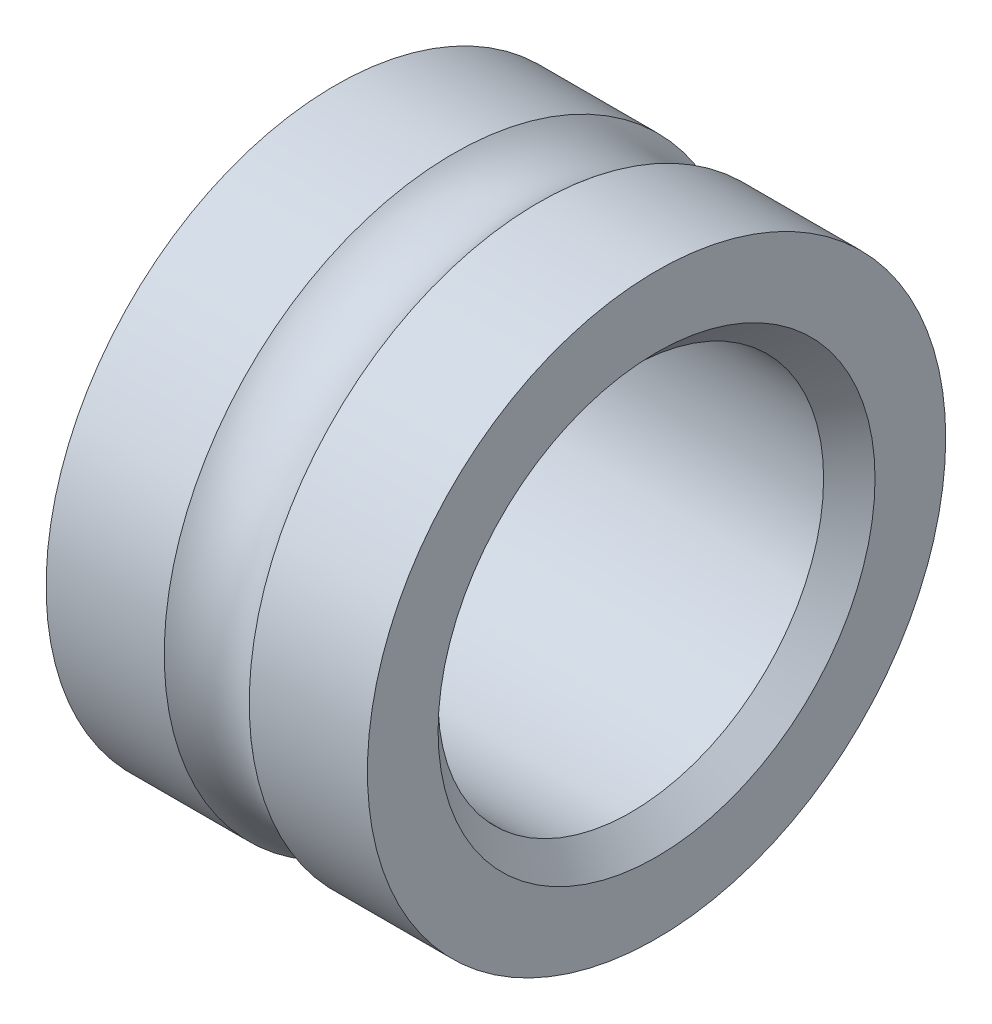
ISO-10303-21;
HEADER;
FILE_DESCRIPTION(('STEP AP214'),'2;1');
FILE_NAME('part.step','',(''),(''),'','','');
FILE_SCHEMA(('AUTOMOTIVE_DESIGN { 1 0 10303 214 1 1 1 1 }'));
ENDSEC;
DATA;
#1=APPLICATION_CONTEXT('core data for automotive mechanical design processes');
#2=APPLICATION_PROTOCOL_DEFINITION('international standard','automotive_design',2000,#1);
#3=PRODUCT_CONTEXT('',#1,'mechanical');
#4=PRODUCT('Part','Part','',(#3));
#5=PRODUCT_RELATED_PRODUCT_CATEGORY('part','',(#4));
#6=PRODUCT_DEFINITION_FORMATION('','',#4);
#7=PRODUCT_DEFINITION_CONTEXT('part definition',#1,'design');
#8=PRODUCT_DEFINITION('design','',#6,#7);
#9=PRODUCT_DEFINITION_SHAPE('','',#8);
#10=(LENGTH_UNIT() NAMED_UNIT(*) SI_UNIT(.MILLI.,.METRE.));
#11=(NAMED_UNIT(*) PLANE_ANGLE_UNIT() SI_UNIT($,.RADIAN.));
#12=(NAMED_UNIT(*) SI_UNIT($,.STERADIAN.) SOLID_ANGLE_UNIT());
#13=UNCERTAINTY_MEASURE_WITH_UNIT(LENGTH_MEASURE(1.E-05),#10,'distance_accuracy_value','');
#14=(GEOMETRIC_REPRESENTATION_CONTEXT(3) GLOBAL_UNCERTAINTY_ASSIGNED_CONTEXT((#13)) GLOBAL_UNIT_ASSIGNED_CONTEXT((#10,
#11,#12)) REPRESENTATION_CONTEXT('',''));
#15=CARTESIAN_POINT('',(0.,0.,0.));
#16=DIRECTION('',(0.,0.,1.));
#17=DIRECTION('',(1.,0.,0.));
#18=AXIS2_PLACEMENT_3D('',#15,#16,#17);
#19=CARTESIAN_POINT('',(0.,4.5,0.));
#20=DIRECTION('',(-1.,0.,0.));
#21=DIRECTION('',(0.,0.,1.));
#22=AXIS2_PLACEMENT_3D('',#19,#20,#21);
#23=PLANE('',#22);
#24=CARTESIAN_POINT('',(0.,0.,0.));
#25=DIRECTION('',(1.,0.,0.));
#26=DIRECTION('',(0.,0.,-1.));
#27=AXIS2_PLACEMENT_3D('',#24,#25,#26);
#28=CIRCLE('',#27,3.4);
#29=CARTESIAN_POINT('',(0.,0.,-3.4));
#30=VERTEX_POINT('',#29);
#31=EDGE_CURVE('E52',#30,#30,#28,.T.);
#32=ORIENTED_EDGE('',*,*,#31,.T.);
#33=EDGE_LOOP('',(#32));
#34=FACE_BOUND('',#33,.T.);
#35=CARTESIAN_POINT('',(0.,0.,0.));
#36=DIRECTION('',(1.,0.,0.));
#37=DIRECTION('',(0.,0.,-1.));
#38=AXIS2_PLACEMENT_3D('',#35,#36,#37);
#39=CIRCLE('',#38,4.5);
#40=CARTESIAN_POINT('',(0.,0.,-4.5));
#41=VERTEX_POINT('',#40);
#42=EDGE_CURVE('E49',#41,#41,#39,.T.);
#43=ORIENTED_EDGE('',*,*,#42,.F.);
#44=EDGE_LOOP('',(#43));
#45=FACE_BOUND('',#44,.T.);
#46=ADVANCED_FACE('F23',(#34,#45),#23,.T.);
#47=CARTESIAN_POINT('',(0.,0.,0.));
#48=DIRECTION('',(-1.,0.,0.));
#49=DIRECTION('',(0.,0.,1.));
#50=AXIS2_PLACEMENT_3D('',#47,#48,#49);
#51=CONICAL_SURFACE('',#50,3.4,0.785398163397448);
#52=CARTESIAN_POINT('',(0.4,0.,0.));
#53=DIRECTION('',(1.,0.,0.));
#54=DIRECTION('',(0.,0.,-1.));
#55=AXIS2_PLACEMENT_3D('',#52,#53,#54);
#56=CIRCLE('',#55,3.);
#57=CARTESIAN_POINT('',(0.4,0.,-3.));
#58=VERTEX_POINT('',#57);
#59=EDGE_CURVE('E46',#58,#58,#56,.T.);
#60=ORIENTED_EDGE('',*,*,#59,.T.);
#61=EDGE_LOOP('',(#60));
#62=FACE_BOUND('',#61,.T.);
#63=ORIENTED_EDGE('',*,*,#31,.F.);
#64=EDGE_LOOP('',(#63));
#65=FACE_BOUND('',#64,.T.);
#66=ADVANCED_FACE('F58',(#62,#65),#51,.F.);
#67=CARTESIAN_POINT('',(5.,0.,0.));
#68=DIRECTION('',(1.,0.,0.));
#69=DIRECTION('',(0.,0.,-1.));
#70=AXIS2_PLACEMENT_3D('',#67,#68,#69);
#71=CYLINDRICAL_SURFACE('',#70,4.5);
#72=ORIENTED_EDGE('',*,*,#42,.T.);
#73=EDGE_LOOP('',(#72));
#74=FACE_BOUND('',#73,.T.);
#75=CARTESIAN_POINT('',(1.8385621722339,0.,0.));
#76=DIRECTION('',(1.,0.,0.));
#77=DIRECTION('',(0.,0.,-1.));
#78=AXIS2_PLACEMENT_3D('',#75,#76,#77);
#79=CIRCLE('',#78,4.5);
#80=CARTESIAN_POINT('',(1.8385621722339,0.,-4.5));
#81=VERTEX_POINT('',#80);
#82=EDGE_CURVE('E43',#81,#81,#79,.T.);
#83=ORIENTED_EDGE('',*,*,#82,.F.);
#84=EDGE_LOOP('',(#83));
#85=FACE_BOUND('',#84,.T.);
#86=ADVANCED_FACE('F60',(#74,#85),#71,.T.);
#87=CARTESIAN_POINT('',(5.,0.,0.));
#88=DIRECTION('',(1.,0.,0.));
#89=DIRECTION('',(0.,0.,-1.));
#90=AXIS2_PLACEMENT_3D('',#87,#88,#89);
#91=CYLINDRICAL_SURFACE('',#90,3.);
#92=CARTESIAN_POINT('',(4.6,0.,0.));
#93=DIRECTION('',(1.,0.,0.));
#94=DIRECTION('',(0.,0.,-1.));
#95=AXIS2_PLACEMENT_3D('',#92,#93,#94);
#96=CIRCLE('',#95,3.);
#97=CARTESIAN_POINT('',(4.6,0.,-3.));
#98=VERTEX_POINT('',#97);
#99=EDGE_CURVE('E38',#98,#98,#96,.T.);
#100=ORIENTED_EDGE('',*,*,#99,.T.);
#101=EDGE_LOOP('',(#100));
#102=FACE_BOUND('',#101,.T.);
#103=ORIENTED_EDGE('',*,*,#59,.F.);
#104=EDGE_LOOP('',(#103));
#105=FACE_BOUND('',#104,.T.);
#106=ADVANCED_FACE('F68',(#102,#105),#91,.F.);
#107=CARTESIAN_POINT('',(2.5,0.,0.));
#108=DIRECTION('',(1.,0.,0.));
#109=DIRECTION('',(0.,0.,-1.));
#110=AXIS2_PLACEMENT_3D('',#107,#108,#109);
#111=TOROIDAL_SURFACE('',#110,5.24999999999987,0.999999999999873);
#112=CARTESIAN_POINT('',(3.1614378277661,0.,0.));
#113=DIRECTION('',(1.,0.,0.));
#114=DIRECTION('',(0.,0.,-1.));
#115=AXIS2_PLACEMENT_3D('',#112,#113,#114);
#116=CIRCLE('',#115,4.5);
#117=CARTESIAN_POINT('',(3.1614378277661,0.,-4.5));
#118=VERTEX_POINT('',#117);
#119=EDGE_CURVE('E34',#118,#118,#116,.T.);
#120=ORIENTED_EDGE('',*,*,#119,.F.);
#121=EDGE_LOOP('',(#120));
#122=FACE_BOUND('',#121,.T.);
#123=ORIENTED_EDGE('',*,*,#82,.T.);
#124=EDGE_LOOP('',(#123));
#125=FACE_BOUND('',#124,.T.);
#126=ADVANCED_FACE('F75',(#122,#125),#111,.F.);
#127=CARTESIAN_POINT('',(4.6,0.,0.));
#128=DIRECTION('',(1.,0.,0.));
#129=DIRECTION('',(0.,0.,-1.));
#130=AXIS2_PLACEMENT_3D('',#127,#128,#129);
#131=CONICAL_SURFACE('',#130,3.,0.785398163397448);
#132=CARTESIAN_POINT('',(5.,0.,0.));
#133=DIRECTION('',(1.,0.,0.));
#134=DIRECTION('',(0.,0.,-1.));
#135=AXIS2_PLACEMENT_3D('',#132,#133,#134);
#136=CIRCLE('',#135,3.4);
#137=CARTESIAN_POINT('',(5.,0.,-3.4));
#138=VERTEX_POINT('',#137);
#139=EDGE_CURVE('E30',#138,#138,#136,.T.);
#140=ORIENTED_EDGE('',*,*,#139,.T.);
#141=EDGE_LOOP('',(#140));
#142=FACE_BOUND('',#141,.T.);
#143=ORIENTED_EDGE('',*,*,#99,.F.);
#144=EDGE_LOOP('',(#143));
#145=FACE_BOUND('',#144,.T.);
#146=ADVANCED_FACE('F79',(#142,#145),#131,.F.);
#147=CARTESIAN_POINT('',(5.,0.,0.));
#148=DIRECTION('',(1.,0.,0.));
#149=DIRECTION('',(0.,0.,-1.));
#150=AXIS2_PLACEMENT_3D('',#147,#148,#149);
#151=CYLINDRICAL_SURFACE('',#150,4.5);
#152=ORIENTED_EDGE('',*,*,#119,.T.);
#153=EDGE_LOOP('',(#152));
#154=FACE_BOUND('',#153,.T.);
#155=CARTESIAN_POINT('',(5.,0.,0.));
#156=DIRECTION('',(1.,0.,0.));
#157=DIRECTION('',(0.,0.,-1.));
#158=AXIS2_PLACEMENT_3D('',#155,#156,#157);
#159=CIRCLE('',#158,4.5);
#160=CARTESIAN_POINT('',(5.,0.,-4.5));
#161=VERTEX_POINT('',#160);
#162=EDGE_CURVE('E12',#161,#161,#159,.T.);
#163=ORIENTED_EDGE('',*,*,#162,.F.);
#164=EDGE_LOOP('',(#163));
#165=FACE_BOUND('',#164,.T.);
#166=ADVANCED_FACE('F82',(#154,#165),#151,.T.);
#167=CARTESIAN_POINT('',(5.,3.4,0.));
#168=DIRECTION('',(1.,0.,0.));
#169=DIRECTION('',(0.,0.,-1.));
#170=AXIS2_PLACEMENT_3D('',#167,#168,#169);
#171=PLANE('',#170);
#172=ORIENTED_EDGE('',*,*,#162,.T.);
#173=EDGE_LOOP('',(#172));
#174=FACE_BOUND('',#173,.T.);
#175=ORIENTED_EDGE('',*,*,#139,.F.);
#176=EDGE_LOOP('',(#175));
#177=FACE_BOUND('',#176,.T.);
#178=ADVANCED_FACE('F25',(#174,#177),#171,.T.);
#179=CLOSED_SHELL('',(#46,#66,#86,#106,#126,#146,#166,#178));
#180=MANIFOLD_SOLID_BREP('B1',#179);
#181=ADVANCED_BREP_SHAPE_REPRESENTATION('',(#18,#180),#14);
#182=SHAPE_DEFINITION_REPRESENTATION(#9,#181);
ENDSEC;
END-ISO-10303-21;
